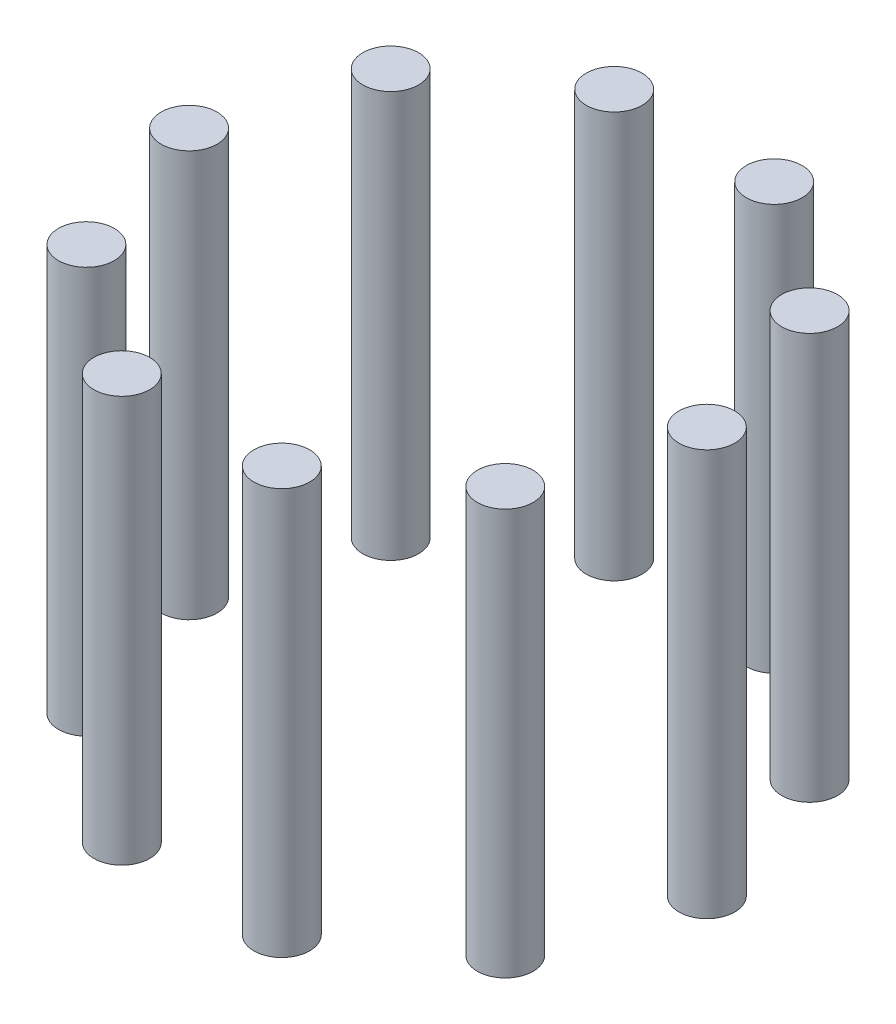
ISO-10303-21;
HEADER;
FILE_DESCRIPTION(('STEP AP214'),'2;1');
FILE_NAME('part.step','',(''),(''),'','','');
FILE_SCHEMA(('AUTOMOTIVE_DESIGN { 1 0 10303 214 1 1 1 1 }'));
ENDSEC;
DATA;
#1=APPLICATION_CONTEXT('core data for automotive mechanical design processes');
#2=APPLICATION_PROTOCOL_DEFINITION('international standard','automotive_design',2000,#1);
#3=PRODUCT_CONTEXT('',#1,'mechanical');
#4=PRODUCT('Part','Part','',(#3));
#5=PRODUCT_RELATED_PRODUCT_CATEGORY('part','',(#4));
#6=PRODUCT_DEFINITION_FORMATION('','',#4);
#7=PRODUCT_DEFINITION_CONTEXT('part definition',#1,'design');
#8=PRODUCT_DEFINITION('design','',#6,#7);
#9=PRODUCT_DEFINITION_SHAPE('','',#8);
#10=(LENGTH_UNIT() NAMED_UNIT(*) SI_UNIT(.MILLI.,.METRE.));
#11=(NAMED_UNIT(*) PLANE_ANGLE_UNIT() SI_UNIT($,.RADIAN.));
#12=(NAMED_UNIT(*) SI_UNIT($,.STERADIAN.) SOLID_ANGLE_UNIT());
#13=UNCERTAINTY_MEASURE_WITH_UNIT(LENGTH_MEASURE(1.E-05),#10,'distance_accuracy_value','');
#14=(GEOMETRIC_REPRESENTATION_CONTEXT(3) GLOBAL_UNCERTAINTY_ASSIGNED_CONTEXT((#13)) GLOBAL_UNIT_ASSIGNED_CONTEXT((#10,
#11,#12)) REPRESENTATION_CONTEXT('',''));
#15=CARTESIAN_POINT('',(0.,0.,0.));
#16=DIRECTION('',(0.,0.,1.));
#17=DIRECTION('',(1.,0.,0.));
#18=AXIS2_PLACEMENT_3D('',#15,#16,#17);
#19=CARTESIAN_POINT('',(41.2598667131227,80.,-29.9770478669156));
#20=DIRECTION('',(0.,-1.,0.));
#21=DIRECTION('',(0.,0.,-1.));
#22=AXIS2_PLACEMENT_3D('',#19,#20,#21);
#23=CYLINDRICAL_SURFACE('',#22,5.49999999999999);
#24=CARTESIAN_POINT('',(41.2598667131227,80.,-29.9770478669156));
#25=DIRECTION('',(0.,1.,0.));
#26=DIRECTION('',(0.,0.,1.));
#27=AXIS2_PLACEMENT_3D('',#24,#25,#26);
#28=CIRCLE('',#27,5.49999999999999);
#29=CARTESIAN_POINT('',(41.2598667131227,80.,-24.4770478669156));
#30=VERTEX_POINT('',#29);
#31=EDGE_CURVE('E48',#30,#30,#28,.T.);
#32=ORIENTED_EDGE('',*,*,#31,.F.);
#33=EDGE_LOOP('',(#32));
#34=FACE_BOUND('',#33,.T.);
#35=CARTESIAN_POINT('',(41.2598667131227,0.,-29.9770478669156));
#36=DIRECTION('',(0.,1.,0.));
#37=DIRECTION('',(0.,0.,1.));
#38=AXIS2_PLACEMENT_3D('',#35,#36,#37);
#39=CIRCLE('',#38,5.49999999999999);
#40=CARTESIAN_POINT('',(41.2598667131227,0.,-24.4770478669156));
#41=VERTEX_POINT('',#40);
#42=EDGE_CURVE('E11',#41,#41,#39,.T.);
#43=ORIENTED_EDGE('',*,*,#42,.T.);
#44=EDGE_LOOP('',(#43));
#45=FACE_BOUND('',#44,.T.);
#46=ADVANCED_FACE('F44',(#34,#45),#23,.T.);
#47=CARTESIAN_POINT('',(41.2598667131227,80.,-29.9770478669156));
#48=DIRECTION('',(0.,1.,0.));
#49=DIRECTION('',(0.,0.,1.));
#50=AXIS2_PLACEMENT_3D('',#47,#48,#49);
#51=PLANE('',#50);
#52=ORIENTED_EDGE('',*,*,#31,.T.);
#53=EDGE_LOOP('',(#52));
#54=FACE_BOUND('',#53,.T.);
#55=ADVANCED_FACE('F46',(#54),#51,.T.);
#56=CARTESIAN_POINT('',(41.2598667131227,0.,-29.9770478669156));
#57=DIRECTION('',(0.,1.,0.));
#58=DIRECTION('',(0.,0.,1.));
#59=AXIS2_PLACEMENT_3D('',#56,#57,#58);
#60=PLANE('',#59);
#61=ORIENTED_EDGE('',*,*,#42,.F.);
#62=EDGE_LOOP('',(#61));
#63=FACE_BOUND('',#62,.T.);
#64=ADVANCED_FACE('F63',(#63),#60,.F.);
#65=CLOSED_SHELL('',(#46,#55,#64));
#66=MANIFOLD_SOLID_BREP('B2',#65);
#67=CARTESIAN_POINT('',(15.7598667131229,80.,-48.5038823310526));
#68=DIRECTION('',(0.,-1.,0.));
#69=DIRECTION('',(0.,0.,-1.));
#70=AXIS2_PLACEMENT_3D('',#67,#68,#69);
#71=CYLINDRICAL_SURFACE('',#70,5.50000000000001);
#72=CARTESIAN_POINT('',(15.7598667131229,80.,-48.5038823310526));
#73=DIRECTION('',(0.,1.,0.));
#74=DIRECTION('',(0.,0.,1.));
#75=AXIS2_PLACEMENT_3D('',#72,#73,#74);
#76=CIRCLE('',#75,5.50000000000001);
#77=CARTESIAN_POINT('',(15.7598667131229,80.,-43.0038823310526));
#78=VERTEX_POINT('',#77);
#79=EDGE_CURVE('E103',#78,#78,#76,.T.);
#80=ORIENTED_EDGE('',*,*,#79,.F.);
#81=EDGE_LOOP('',(#80));
#82=FACE_BOUND('',#81,.T.);
#83=CARTESIAN_POINT('',(15.7598667131229,0.,-48.5038823310526));
#84=DIRECTION('',(0.,1.,0.));
#85=DIRECTION('',(0.,0.,1.));
#86=AXIS2_PLACEMENT_3D('',#83,#84,#85);
#87=CIRCLE('',#86,5.50000000000001);
#88=CARTESIAN_POINT('',(15.7598667131229,0.,-43.0038823310526));
#89=VERTEX_POINT('',#88);
#90=EDGE_CURVE('E43',#89,#89,#87,.T.);
#91=ORIENTED_EDGE('',*,*,#90,.T.);
#92=EDGE_LOOP('',(#91));
#93=FACE_BOUND('',#92,.T.);
#94=ADVANCED_FACE('F99',(#82,#93),#71,.T.);
#95=CARTESIAN_POINT('',(15.7598667131229,80.,-48.5038823310526));
#96=DIRECTION('',(0.,1.,0.));
#97=DIRECTION('',(0.,0.,1.));
#98=AXIS2_PLACEMENT_3D('',#95,#96,#97);
#99=PLANE('',#98);
#100=ORIENTED_EDGE('',*,*,#79,.T.);
#101=EDGE_LOOP('',(#100));
#102=FACE_BOUND('',#101,.T.);
#103=ADVANCED_FACE('F101',(#102),#99,.T.);
#104=CARTESIAN_POINT('',(15.7598667131229,0.,-48.5038823310526));
#105=DIRECTION('',(0.,1.,0.));
#106=DIRECTION('',(0.,0.,1.));
#107=AXIS2_PLACEMENT_3D('',#104,#105,#106);
#108=PLANE('',#107);
#109=ORIENTED_EDGE('',*,*,#90,.F.);
#110=EDGE_LOOP('',(#109));
#111=FACE_BOUND('',#110,.T.);
#112=ADVANCED_FACE('F118',(#111),#108,.F.);
#113=CLOSED_SHELL('',(#94,#103,#112));
#114=MANIFOLD_SOLID_BREP('B6',#113);
#115=CARTESIAN_POINT('',(-15.7598667131219,80.,-48.503882331053));
#116=DIRECTION('',(0.,-1.,0.));
#117=DIRECTION('',(0.,0.,-1.));
#118=AXIS2_PLACEMENT_3D('',#115,#116,#117);
#119=CYLINDRICAL_SURFACE('',#118,5.5);
#120=CARTESIAN_POINT('',(-15.7598667131219,80.,-48.503882331053));
#121=DIRECTION('',(0.,1.,0.));
#122=DIRECTION('',(0.,0.,1.));
#123=AXIS2_PLACEMENT_3D('',#120,#121,#122);
#124=CIRCLE('',#123,5.5);
#125=CARTESIAN_POINT('',(-15.7598667131219,80.,-43.003882331053));
#126=VERTEX_POINT('',#125);
#127=EDGE_CURVE('E158',#126,#126,#124,.T.);
#128=ORIENTED_EDGE('',*,*,#127,.F.);
#129=EDGE_LOOP('',(#128));
#130=FACE_BOUND('',#129,.T.);
#131=CARTESIAN_POINT('',(-15.7598667131219,0.,-48.503882331053));
#132=DIRECTION('',(0.,1.,0.));
#133=DIRECTION('',(0.,0.,1.));
#134=AXIS2_PLACEMENT_3D('',#131,#132,#133);
#135=CIRCLE('',#134,5.5);
#136=CARTESIAN_POINT('',(-15.7598667131219,0.,-43.003882331053));
#137=VERTEX_POINT('',#136);
#138=EDGE_CURVE('E98',#137,#137,#135,.T.);
#139=ORIENTED_EDGE('',*,*,#138,.T.);
#140=EDGE_LOOP('',(#139));
#141=FACE_BOUND('',#140,.T.);
#142=ADVANCED_FACE('F154',(#130,#141),#119,.T.);
#143=CARTESIAN_POINT('',(-15.7598667131219,80.,-48.503882331053));
#144=DIRECTION('',(0.,1.,0.));
#145=DIRECTION('',(0.,0.,1.));
#146=AXIS2_PLACEMENT_3D('',#143,#144,#145);
#147=PLANE('',#146);
#148=ORIENTED_EDGE('',*,*,#127,.T.);
#149=EDGE_LOOP('',(#148));
#150=FACE_BOUND('',#149,.T.);
#151=ADVANCED_FACE('F156',(#150),#147,.T.);
#152=CARTESIAN_POINT('',(-15.7598667131219,0.,-48.503882331053));
#153=DIRECTION('',(0.,1.,0.));
#154=DIRECTION('',(0.,0.,1.));
#155=AXIS2_PLACEMENT_3D('',#152,#153,#154);
#156=PLANE('',#155);
#157=ORIENTED_EDGE('',*,*,#138,.F.);
#158=EDGE_LOOP('',(#157));
#159=FACE_BOUND('',#158,.T.);
#160=ADVANCED_FACE('F173',(#159),#156,.F.);
#161=CLOSED_SHELL('',(#142,#151,#160));
#162=MANIFOLD_SOLID_BREP('B38',#161);
#163=CARTESIAN_POINT('',(-41.259866713122,80.,-29.9770478669165));
#164=DIRECTION('',(0.,-1.,0.));
#165=DIRECTION('',(0.,0.,-1.));
#166=AXIS2_PLACEMENT_3D('',#163,#164,#165);
#167=CYLINDRICAL_SURFACE('',#166,5.49999999999999);
#168=CARTESIAN_POINT('',(-41.259866713122,80.,-29.9770478669165));
#169=DIRECTION('',(0.,1.,0.));
#170=DIRECTION('',(0.,0.,1.));
#171=AXIS2_PLACEMENT_3D('',#168,#169,#170);
#172=CIRCLE('',#171,5.49999999999999);
#173=CARTESIAN_POINT('',(-41.259866713122,80.,-24.4770478669165));
#174=VERTEX_POINT('',#173);
#175=EDGE_CURVE('E213',#174,#174,#172,.T.);
#176=ORIENTED_EDGE('',*,*,#175,.F.);
#177=EDGE_LOOP('',(#176));
#178=FACE_BOUND('',#177,.T.);
#179=CARTESIAN_POINT('',(-41.259866713122,0.,-29.9770478669165));
#180=DIRECTION('',(0.,1.,0.));
#181=DIRECTION('',(0.,0.,1.));
#182=AXIS2_PLACEMENT_3D('',#179,#180,#181);
#183=CIRCLE('',#182,5.49999999999999);
#184=CARTESIAN_POINT('',(-41.259866713122,0.,-24.4770478669165));
#185=VERTEX_POINT('',#184);
#186=EDGE_CURVE('E153',#185,#185,#183,.T.);
#187=ORIENTED_EDGE('',*,*,#186,.T.);
#188=EDGE_LOOP('',(#187));
#189=FACE_BOUND('',#188,.T.);
#190=ADVANCED_FACE('F209',(#178,#189),#167,.T.);
#191=CARTESIAN_POINT('',(-41.259866713122,80.,-29.9770478669165));
#192=DIRECTION('',(0.,1.,0.));
#193=DIRECTION('',(0.,0.,1.));
#194=AXIS2_PLACEMENT_3D('',#191,#192,#193);
#195=PLANE('',#194);
#196=ORIENTED_EDGE('',*,*,#175,.T.);
#197=EDGE_LOOP('',(#196));
#198=FACE_BOUND('',#197,.T.);
#199=ADVANCED_FACE('F211',(#198),#195,.T.);
#200=CARTESIAN_POINT('',(-41.259866713122,0.,-29.9770478669165));
#201=DIRECTION('',(0.,1.,0.));
#202=DIRECTION('',(0.,0.,1.));
#203=AXIS2_PLACEMENT_3D('',#200,#201,#202);
#204=PLANE('',#203);
#205=ORIENTED_EDGE('',*,*,#186,.F.);
#206=EDGE_LOOP('',(#205));
#207=FACE_BOUND('',#206,.T.);
#208=ADVANCED_FACE('F228',(#207),#204,.F.);
#209=CLOSED_SHELL('',(#190,#199,#208));
#210=MANIFOLD_SOLID_BREP('B93',#209);
#211=CARTESIAN_POINT('',(-51.,80.,-3.56131096562E-13));
#212=DIRECTION('',(0.,-1.,0.));
#213=DIRECTION('',(0.,0.,-1.));
#214=AXIS2_PLACEMENT_3D('',#211,#212,#213);
#215=CYLINDRICAL_SURFACE('',#214,5.5);
#216=CARTESIAN_POINT('',(-51.,80.,-3.56131096562E-13));
#217=DIRECTION('',(0.,1.,0.));
#218=DIRECTION('',(0.,0.,1.));
#219=AXIS2_PLACEMENT_3D('',#216,#217,#218);
#220=CIRCLE('',#219,5.5);
#221=CARTESIAN_POINT('',(-51.,80.,5.49999999999964));
#222=VERTEX_POINT('',#221);
#223=EDGE_CURVE('E268',#222,#222,#220,.T.);
#224=ORIENTED_EDGE('',*,*,#223,.F.);
#225=EDGE_LOOP('',(#224));
#226=FACE_BOUND('',#225,.T.);
#227=CARTESIAN_POINT('',(-51.,0.,-3.56131096562E-13));
#228=DIRECTION('',(0.,1.,0.));
#229=DIRECTION('',(0.,0.,1.));
#230=AXIS2_PLACEMENT_3D('',#227,#228,#229);
#231=CIRCLE('',#230,5.5);
#232=CARTESIAN_POINT('',(-51.,0.,5.49999999999964));
#233=VERTEX_POINT('',#232);
#234=EDGE_CURVE('E208',#233,#233,#231,.T.);
#235=ORIENTED_EDGE('',*,*,#234,.T.);
#236=EDGE_LOOP('',(#235));
#237=FACE_BOUND('',#236,.T.);
#238=ADVANCED_FACE('F264',(#226,#237),#215,.T.);
#239=CARTESIAN_POINT('',(-51.,80.,-3.56131096562E-13));
#240=DIRECTION('',(0.,1.,0.));
#241=DIRECTION('',(0.,0.,1.));
#242=AXIS2_PLACEMENT_3D('',#239,#240,#241);
#243=PLANE('',#242);
#244=ORIENTED_EDGE('',*,*,#223,.T.);
#245=EDGE_LOOP('',(#244));
#246=FACE_BOUND('',#245,.T.);
#247=ADVANCED_FACE('F266',(#246),#243,.T.);
#248=CARTESIAN_POINT('',(-51.,0.,-3.56131096562E-13));
#249=DIRECTION('',(0.,1.,0.));
#250=DIRECTION('',(0.,0.,1.));
#251=AXIS2_PLACEMENT_3D('',#248,#249,#250);
#252=PLANE('',#251);
#253=ORIENTED_EDGE('',*,*,#234,.F.);
#254=EDGE_LOOP('',(#253));
#255=FACE_BOUND('',#254,.T.);
#256=ADVANCED_FACE('F283',(#255),#252,.F.);
#257=CLOSED_SHELL('',(#238,#247,#256));
#258=MANIFOLD_SOLID_BREP('B148',#257);
#259=CARTESIAN_POINT('',(-41.2598667131225,80.,29.9770478669159));
#260=DIRECTION('',(0.,-1.,0.));
#261=DIRECTION('',(0.,0.,-1.));
#262=AXIS2_PLACEMENT_3D('',#259,#260,#261);
#263=CYLINDRICAL_SURFACE('',#262,5.5);
#264=CARTESIAN_POINT('',(-41.2598667131225,80.,29.9770478669159));
#265=DIRECTION('',(0.,1.,0.));
#266=DIRECTION('',(0.,0.,1.));
#267=AXIS2_PLACEMENT_3D('',#264,#265,#266);
#268=CIRCLE('',#267,5.5);
#269=CARTESIAN_POINT('',(-41.2598667131225,80.,35.4770478669159));
#270=VERTEX_POINT('',#269);
#271=EDGE_CURVE('E323',#270,#270,#268,.T.);
#272=ORIENTED_EDGE('',*,*,#271,.F.);
#273=EDGE_LOOP('',(#272));
#274=FACE_BOUND('',#273,.T.);
#275=CARTESIAN_POINT('',(-41.2598667131225,0.,29.9770478669159));
#276=DIRECTION('',(0.,1.,0.));
#277=DIRECTION('',(0.,0.,1.));
#278=AXIS2_PLACEMENT_3D('',#275,#276,#277);
#279=CIRCLE('',#278,5.5);
#280=CARTESIAN_POINT('',(-41.2598667131225,0.,35.4770478669159));
#281=VERTEX_POINT('',#280);
#282=EDGE_CURVE('E263',#281,#281,#279,.T.);
#283=ORIENTED_EDGE('',*,*,#282,.T.);
#284=EDGE_LOOP('',(#283));
#285=FACE_BOUND('',#284,.T.);
#286=ADVANCED_FACE('F319',(#274,#285),#263,.T.);
#287=CARTESIAN_POINT('',(-41.2598667131225,80.,29.9770478669159));
#288=DIRECTION('',(0.,1.,0.));
#289=DIRECTION('',(0.,0.,1.));
#290=AXIS2_PLACEMENT_3D('',#287,#288,#289);
#291=PLANE('',#290);
#292=ORIENTED_EDGE('',*,*,#271,.T.);
#293=EDGE_LOOP('',(#292));
#294=FACE_BOUND('',#293,.T.);
#295=ADVANCED_FACE('F321',(#294),#291,.T.);
#296=CARTESIAN_POINT('',(-41.2598667131225,0.,29.9770478669159));
#297=DIRECTION('',(0.,1.,0.));
#298=DIRECTION('',(0.,0.,1.));
#299=AXIS2_PLACEMENT_3D('',#296,#297,#298);
#300=PLANE('',#299);
#301=ORIENTED_EDGE('',*,*,#282,.F.);
#302=EDGE_LOOP('',(#301));
#303=FACE_BOUND('',#302,.T.);
#304=ADVANCED_FACE('F338',(#303),#300,.F.);
#305=CLOSED_SHELL('',(#286,#295,#304));
#306=MANIFOLD_SOLID_BREP('B203',#305);
#307=CARTESIAN_POINT('',(-15.7598667131225,80.,48.5038823310528));
#308=DIRECTION('',(0.,-1.,0.));
#309=DIRECTION('',(0.,0.,-1.));
#310=AXIS2_PLACEMENT_3D('',#307,#308,#309);
#311=CYLINDRICAL_SURFACE('',#310,5.49999999999999);
#312=CARTESIAN_POINT('',(-15.7598667131225,80.,48.5038823310528));
#313=DIRECTION('',(0.,1.,0.));
#314=DIRECTION('',(0.,0.,1.));
#315=AXIS2_PLACEMENT_3D('',#312,#313,#314);
#316=CIRCLE('',#315,5.49999999999999);
#317=CARTESIAN_POINT('',(-15.7598667131225,80.,54.0038823310528));
#318=VERTEX_POINT('',#317);
#319=EDGE_CURVE('E378',#318,#318,#316,.T.);
#320=ORIENTED_EDGE('',*,*,#319,.F.);
#321=EDGE_LOOP('',(#320));
#322=FACE_BOUND('',#321,.T.);
#323=CARTESIAN_POINT('',(-15.7598667131225,0.,48.5038823310528));
#324=DIRECTION('',(0.,1.,0.));
#325=DIRECTION('',(0.,0.,1.));
#326=AXIS2_PLACEMENT_3D('',#323,#324,#325);
#327=CIRCLE('',#326,5.49999999999999);
#328=CARTESIAN_POINT('',(-15.7598667131225,0.,54.0038823310528));
#329=VERTEX_POINT('',#328);
#330=EDGE_CURVE('E318',#329,#329,#327,.T.);
#331=ORIENTED_EDGE('',*,*,#330,.T.);
#332=EDGE_LOOP('',(#331));
#333=FACE_BOUND('',#332,.T.);
#334=ADVANCED_FACE('F374',(#322,#333),#311,.T.);
#335=CARTESIAN_POINT('',(-15.7598667131225,80.,48.5038823310528));
#336=DIRECTION('',(0.,1.,0.));
#337=DIRECTION('',(0.,0.,1.));
#338=AXIS2_PLACEMENT_3D('',#335,#336,#337);
#339=PLANE('',#338);
#340=ORIENTED_EDGE('',*,*,#319,.T.);
#341=EDGE_LOOP('',(#340));
#342=FACE_BOUND('',#341,.T.);
#343=ADVANCED_FACE('F376',(#342),#339,.T.);
#344=CARTESIAN_POINT('',(-15.7598667131225,0.,48.5038823310528));
#345=DIRECTION('',(0.,1.,0.));
#346=DIRECTION('',(0.,0.,1.));
#347=AXIS2_PLACEMENT_3D('',#344,#345,#346);
#348=PLANE('',#347);
#349=ORIENTED_EDGE('',*,*,#330,.F.);
#350=EDGE_LOOP('',(#349));
#351=FACE_BOUND('',#350,.T.);
#352=ADVANCED_FACE('F393',(#351),#348,.F.);
#353=CLOSED_SHELL('',(#334,#343,#352));
#354=MANIFOLD_SOLID_BREP('B258',#353);
#355=CARTESIAN_POINT('',(15.7598667131222,80.,48.5038823310529));
#356=DIRECTION('',(0.,-1.,0.));
#357=DIRECTION('',(0.,0.,-1.));
#358=AXIS2_PLACEMENT_3D('',#355,#356,#357);
#359=CYLINDRICAL_SURFACE('',#358,5.5);
#360=CARTESIAN_POINT('',(15.7598667131222,80.,48.5038823310529));
#361=DIRECTION('',(0.,1.,0.));
#362=DIRECTION('',(0.,0.,1.));
#363=AXIS2_PLACEMENT_3D('',#360,#361,#362);
#364=CIRCLE('',#363,5.5);
#365=CARTESIAN_POINT('',(15.7598667131222,80.,54.0038823310529));
#366=VERTEX_POINT('',#365);
#367=EDGE_CURVE('E433',#366,#366,#364,.T.);
#368=ORIENTED_EDGE('',*,*,#367,.F.);
#369=EDGE_LOOP('',(#368));
#370=FACE_BOUND('',#369,.T.);
#371=CARTESIAN_POINT('',(15.7598667131222,0.,48.5038823310529));
#372=DIRECTION('',(0.,1.,0.));
#373=DIRECTION('',(0.,0.,1.));
#374=AXIS2_PLACEMENT_3D('',#371,#372,#373);
#375=CIRCLE('',#374,5.5);
#376=CARTESIAN_POINT('',(15.7598667131222,0.,54.0038823310529));
#377=VERTEX_POINT('',#376);
#378=EDGE_CURVE('E373',#377,#377,#375,.T.);
#379=ORIENTED_EDGE('',*,*,#378,.T.);
#380=EDGE_LOOP('',(#379));
#381=FACE_BOUND('',#380,.T.);
#382=ADVANCED_FACE('F429',(#370,#381),#359,.T.);
#383=CARTESIAN_POINT('',(15.7598667131222,80.,48.5038823310529));
#384=DIRECTION('',(0.,1.,0.));
#385=DIRECTION('',(0.,0.,1.));
#386=AXIS2_PLACEMENT_3D('',#383,#384,#385);
#387=PLANE('',#386);
#388=ORIENTED_EDGE('',*,*,#367,.T.);
#389=EDGE_LOOP('',(#388));
#390=FACE_BOUND('',#389,.T.);
#391=ADVANCED_FACE('F431',(#390),#387,.T.);
#392=CARTESIAN_POINT('',(15.7598667131222,0.,48.5038823310529));
#393=DIRECTION('',(0.,1.,0.));
#394=DIRECTION('',(0.,0.,1.));
#395=AXIS2_PLACEMENT_3D('',#392,#393,#394);
#396=PLANE('',#395);
#397=ORIENTED_EDGE('',*,*,#378,.F.);
#398=EDGE_LOOP('',(#397));
#399=FACE_BOUND('',#398,.T.);
#400=ADVANCED_FACE('F448',(#399),#396,.F.);
#401=CLOSED_SHELL('',(#382,#391,#400));
#402=MANIFOLD_SOLID_BREP('B313',#401);
#403=CARTESIAN_POINT('',(41.2598667131223,80.,29.9770478669162));
#404=DIRECTION('',(0.,-1.,0.));
#405=DIRECTION('',(0.,0.,-1.));
#406=AXIS2_PLACEMENT_3D('',#403,#404,#405);
#407=CYLINDRICAL_SURFACE('',#406,5.5);
#408=CARTESIAN_POINT('',(41.2598667131223,80.,29.9770478669162));
#409=DIRECTION('',(0.,1.,0.));
#410=DIRECTION('',(0.,0.,1.));
#411=AXIS2_PLACEMENT_3D('',#408,#409,#410);
#412=CIRCLE('',#411,5.5);
#413=CARTESIAN_POINT('',(41.2598667131223,80.,35.4770478669162));
#414=VERTEX_POINT('',#413);
#415=EDGE_CURVE('E487',#414,#414,#412,.T.);
#416=ORIENTED_EDGE('',*,*,#415,.F.);
#417=EDGE_LOOP('',(#416));
#418=FACE_BOUND('',#417,.T.);
#419=CARTESIAN_POINT('',(41.2598667131223,0.,29.9770478669162));
#420=DIRECTION('',(0.,1.,0.));
#421=DIRECTION('',(0.,0.,1.));
#422=AXIS2_PLACEMENT_3D('',#419,#420,#421);
#423=CIRCLE('',#422,5.5);
#424=CARTESIAN_POINT('',(41.2598667131223,0.,35.4770478669162));
#425=VERTEX_POINT('',#424);
#426=EDGE_CURVE('E428',#425,#425,#423,.T.);
#427=ORIENTED_EDGE('',*,*,#426,.T.);
#428=EDGE_LOOP('',(#427));
#429=FACE_BOUND('',#428,.T.);
#430=ADVANCED_FACE('F483',(#418,#429),#407,.T.);
#431=CARTESIAN_POINT('',(41.2598667131223,80.,29.9770478669162));
#432=DIRECTION('',(0.,1.,0.));
#433=DIRECTION('',(0.,0.,1.));
#434=AXIS2_PLACEMENT_3D('',#431,#432,#433);
#435=PLANE('',#434);
#436=ORIENTED_EDGE('',*,*,#415,.T.);
#437=EDGE_LOOP('',(#436));
#438=FACE_BOUND('',#437,.T.);
#439=ADVANCED_FACE('F485',(#438),#435,.T.);
#440=CARTESIAN_POINT('',(41.2598667131223,0.,29.9770478669162));
#441=DIRECTION('',(0.,1.,0.));
#442=DIRECTION('',(0.,0.,1.));
#443=AXIS2_PLACEMENT_3D('',#440,#441,#442);
#444=PLANE('',#443);
#445=ORIENTED_EDGE('',*,*,#426,.F.);
#446=EDGE_LOOP('',(#445));
#447=FACE_BOUND('',#446,.T.);
#448=ADVANCED_FACE('F502',(#447),#444,.F.);
#449=CLOSED_SHELL('',(#430,#439,#448));
#450=MANIFOLD_SOLID_BREP('B368',#449);
#451=CARTESIAN_POINT('',(51.,80.,0.));
#452=DIRECTION('',(0.,-1.,0.));
#453=DIRECTION('',(0.,0.,-1.));
#454=AXIS2_PLACEMENT_3D('',#451,#452,#453);
#455=CYLINDRICAL_SURFACE('',#454,5.5);
#456=CARTESIAN_POINT('',(51.,80.,0.));
#457=DIRECTION('',(0.,1.,0.));
#458=DIRECTION('',(0.,0.,1.));
#459=AXIS2_PLACEMENT_3D('',#456,#457,#458);
#460=CIRCLE('',#459,5.5);
#461=CARTESIAN_POINT('',(51.,80.,5.5));
#462=VERTEX_POINT('',#461);
#463=EDGE_CURVE('E482',#462,#462,#460,.T.);
#464=ORIENTED_EDGE('',*,*,#463,.F.);
#465=EDGE_LOOP('',(#464));
#466=FACE_BOUND('',#465,.T.);
#467=CARTESIAN_POINT('',(51.,0.,0.));
#468=DIRECTION('',(0.,1.,0.));
#469=DIRECTION('',(0.,0.,1.));
#470=AXIS2_PLACEMENT_3D('',#467,#468,#469);
#471=CIRCLE('',#470,5.5);
#472=CARTESIAN_POINT('',(51.,0.,5.5));
#473=VERTEX_POINT('',#472);
#474=EDGE_CURVE('E533',#473,#473,#471,.T.);
#475=ORIENTED_EDGE('',*,*,#474,.T.);
#476=EDGE_LOOP('',(#475));
#477=FACE_BOUND('',#476,.T.);
#478=ADVANCED_FACE('F530',(#466,#477),#455,.T.);
#479=CARTESIAN_POINT('',(51.,80.,0.));
#480=DIRECTION('',(0.,1.,0.));
#481=DIRECTION('',(0.,0.,1.));
#482=AXIS2_PLACEMENT_3D('',#479,#480,#481);
#483=PLANE('',#482);
#484=ORIENTED_EDGE('',*,*,#463,.T.);
#485=EDGE_LOOP('',(#484));
#486=FACE_BOUND('',#485,.T.);
#487=ADVANCED_FACE('F545',(#486),#483,.T.);
#488=CARTESIAN_POINT('',(51.,0.,0.));
#489=DIRECTION('',(0.,1.,0.));
#490=DIRECTION('',(0.,0.,1.));
#491=AXIS2_PLACEMENT_3D('',#488,#489,#490);
#492=PLANE('',#491);
#493=ORIENTED_EDGE('',*,*,#474,.F.);
#494=EDGE_LOOP('',(#493));
#495=FACE_BOUND('',#494,.T.);
#496=ADVANCED_FACE('F543',(#495),#492,.F.);
#497=CLOSED_SHELL('',(#478,#487,#496));
#498=MANIFOLD_SOLID_BREP('B423',#497);
#499=ADVANCED_BREP_SHAPE_REPRESENTATION('',(#18,#66,#114,#162,#210,#258,#306,#354,#402,#450,
#498),#14);
#500=SHAPE_DEFINITION_REPRESENTATION(#9,#499);
ENDSEC;
END-ISO-10303-21;
